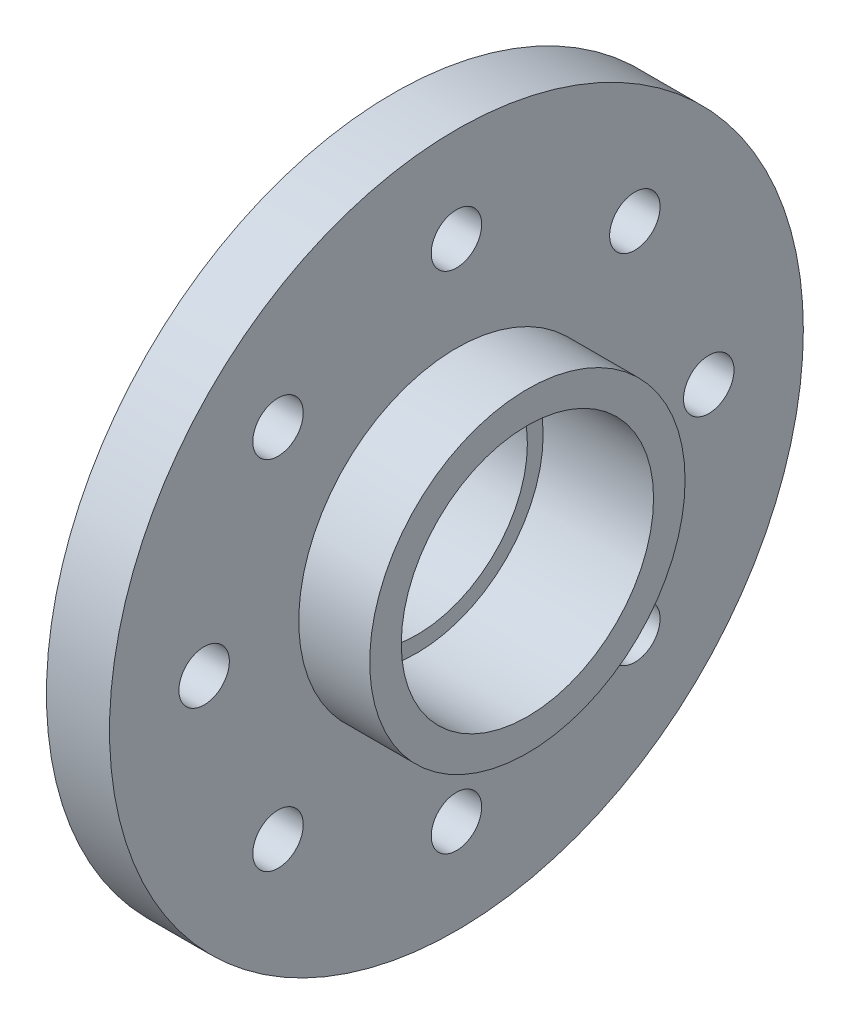
ISO-10303-21;
HEADER;
FILE_DESCRIPTION(('STEP AP214'),'2;1');
FILE_NAME('part.step','',(''),(''),'','','');
FILE_SCHEMA(('AUTOMOTIVE_DESIGN { 1 0 10303 214 1 1 1 1 }'));
ENDSEC;
DATA;
#1=APPLICATION_CONTEXT('core data for automotive mechanical design processes');
#2=APPLICATION_PROTOCOL_DEFINITION('international standard','automotive_design',2000,#1);
#3=PRODUCT_CONTEXT('',#1,'mechanical');
#4=PRODUCT('Part','Part','',(#3));
#5=PRODUCT_RELATED_PRODUCT_CATEGORY('part','',(#4));
#6=PRODUCT_DEFINITION_FORMATION('','',#4);
#7=PRODUCT_DEFINITION_CONTEXT('part definition',#1,'design');
#8=PRODUCT_DEFINITION('design','',#6,#7);
#9=PRODUCT_DEFINITION_SHAPE('','',#8);
#10=(LENGTH_UNIT() NAMED_UNIT(*) SI_UNIT(.MILLI.,.METRE.));
#11=(NAMED_UNIT(*) PLANE_ANGLE_UNIT() SI_UNIT($,.RADIAN.));
#12=(NAMED_UNIT(*) SI_UNIT($,.STERADIAN.) SOLID_ANGLE_UNIT());
#13=UNCERTAINTY_MEASURE_WITH_UNIT(LENGTH_MEASURE(1.E-05),#10,'distance_accuracy_value','');
#14=(GEOMETRIC_REPRESENTATION_CONTEXT(3) GLOBAL_UNCERTAINTY_ASSIGNED_CONTEXT((#13)) GLOBAL_UNIT_ASSIGNED_CONTEXT((#10,
#11,#12)) REPRESENTATION_CONTEXT('',''));
#15=CARTESIAN_POINT('',(0.,0.,0.));
#16=DIRECTION('',(0.,0.,1.));
#17=DIRECTION('',(1.,0.,0.));
#18=AXIS2_PLACEMENT_3D('',#15,#16,#17);
#19=CARTESIAN_POINT('',(3.25,0.,0.));
#20=DIRECTION('',(1.,0.,0.));
#21=DIRECTION('',(0.,0.,-1.));
#22=AXIS2_PLACEMENT_3D('',#19,#20,#21);
#23=PLANE('',#22);
#24=CARTESIAN_POINT('',(3.25,0.,-8.));
#25=DIRECTION('',(1.,0.,0.));
#26=DIRECTION('',(0.,0.,-1.));
#27=AXIS2_PLACEMENT_3D('',#24,#25,#26);
#28=CIRCLE('',#27,0.79999999999999);
#29=CARTESIAN_POINT('',(3.25,0.,-8.79999999999999));
#30=VERTEX_POINT('',#29);
#31=EDGE_CURVE('E125',#30,#30,#28,.T.);
#32=ORIENTED_EDGE('',*,*,#31,.F.);
#33=EDGE_LOOP('',(#32));
#34=FACE_BOUND('',#33,.T.);
#35=CARTESIAN_POINT('',(3.25,8.,0.));
#36=DIRECTION('',(1.,0.,0.));
#37=DIRECTION('',(0.,0.,-1.));
#38=AXIS2_PLACEMENT_3D('',#35,#36,#37);
#39=CIRCLE('',#38,0.79999999999999);
#40=CARTESIAN_POINT('',(3.25,8.,-0.79999999999999));
#41=VERTEX_POINT('',#40);
#42=EDGE_CURVE('E119',#41,#41,#39,.T.);
#43=ORIENTED_EDGE('',*,*,#42,.F.);
#44=EDGE_LOOP('',(#43));
#45=FACE_BOUND('',#44,.T.);
#46=CARTESIAN_POINT('',(3.25,5.65685424949245,5.65685424949231));
#47=DIRECTION('',(1.,0.,0.));
#48=DIRECTION('',(0.,0.,-1.));
#49=AXIS2_PLACEMENT_3D('',#46,#47,#48);
#50=CIRCLE('',#49,0.79999999999999);
#51=CARTESIAN_POINT('',(3.25,5.65685424949245,4.85685424949232));
#52=VERTEX_POINT('',#51);
#53=EDGE_CURVE('E113',#52,#52,#50,.T.);
#54=ORIENTED_EDGE('',*,*,#53,.F.);
#55=EDGE_LOOP('',(#54));
#56=FACE_BOUND('',#55,.T.);
#57=CARTESIAN_POINT('',(3.25,5.65685424949237,-5.65685424949239));
#58=DIRECTION('',(1.,0.,0.));
#59=DIRECTION('',(0.,0.,-1.));
#60=AXIS2_PLACEMENT_3D('',#57,#58,#59);
#61=CIRCLE('',#60,0.79999999999999);
#62=CARTESIAN_POINT('',(3.25,5.65685424949237,-6.45685424949238));
#63=VERTEX_POINT('',#62);
#64=EDGE_CURVE('E110',#63,#63,#61,.T.);
#65=ORIENTED_EDGE('',*,*,#64,.F.);
#66=EDGE_LOOP('',(#65));
#67=FACE_BOUND('',#66,.T.);
#68=CARTESIAN_POINT('',(3.25,-5.65685424949241,-5.65685424949235));
#69=DIRECTION('',(1.,0.,0.));
#70=DIRECTION('',(0.,0.,-1.));
#71=AXIS2_PLACEMENT_3D('',#68,#69,#70);
#72=CIRCLE('',#71,0.79999999999999);
#73=CARTESIAN_POINT('',(3.25,-5.65685424949241,-6.45685424949234));
#74=VERTEX_POINT('',#73);
#75=EDGE_CURVE('E104',#74,#74,#72,.T.);
#76=ORIENTED_EDGE('',*,*,#75,.F.);
#77=EDGE_LOOP('',(#76));
#78=FACE_BOUND('',#77,.T.);
#79=CARTESIAN_POINT('',(3.25,-8.,0.));
#80=DIRECTION('',(1.,0.,0.));
#81=DIRECTION('',(0.,0.,-1.));
#82=AXIS2_PLACEMENT_3D('',#79,#80,#81);
#83=CIRCLE('',#82,0.79999999999999);
#84=CARTESIAN_POINT('',(3.25,-8.,-0.799999999999934));
#85=VERTEX_POINT('',#84);
#86=EDGE_CURVE('E98',#85,#85,#83,.T.);
#87=ORIENTED_EDGE('',*,*,#86,.F.);
#88=EDGE_LOOP('',(#87));
#89=FACE_BOUND('',#88,.T.);
#90=CARTESIAN_POINT('',(3.25,-5.65685424949233,5.65685424949243));
#91=DIRECTION('',(1.,0.,0.));
#92=DIRECTION('',(0.,0.,-1.));
#93=AXIS2_PLACEMENT_3D('',#90,#91,#92);
#94=CIRCLE('',#93,0.79999999999999);
#95=CARTESIAN_POINT('',(3.25,-5.65685424949233,4.85685424949244));
#96=VERTEX_POINT('',#95);
#97=EDGE_CURVE('E92',#96,#96,#94,.T.);
#98=ORIENTED_EDGE('',*,*,#97,.F.);
#99=EDGE_LOOP('',(#98));
#100=FACE_BOUND('',#99,.T.);
#101=CARTESIAN_POINT('',(3.25,0.,8.));
#102=DIRECTION('',(1.,0.,0.));
#103=DIRECTION('',(0.,0.,-1.));
#104=AXIS2_PLACEMENT_3D('',#101,#102,#103);
#105=CIRCLE('',#104,0.79999999999999);
#106=CARTESIAN_POINT('',(3.25,0.,7.20000000000001));
#107=VERTEX_POINT('',#106);
#108=EDGE_CURVE('E86',#107,#107,#105,.T.);
#109=ORIENTED_EDGE('',*,*,#108,.F.);
#110=EDGE_LOOP('',(#109));
#111=FACE_BOUND('',#110,.T.);
#112=CARTESIAN_POINT('',(3.25,0.,0.));
#113=DIRECTION('',(1.,0.,0.));
#114=DIRECTION('',(0.,0.,-1.));
#115=AXIS2_PLACEMENT_3D('',#112,#113,#114);
#116=CIRCLE('',#115,11.);
#117=CARTESIAN_POINT('',(3.25,0.,-11.));
#118=VERTEX_POINT('',#117);
#119=EDGE_CURVE('E66',#118,#118,#116,.T.);
#120=ORIENTED_EDGE('',*,*,#119,.T.);
#121=EDGE_LOOP('',(#120));
#122=FACE_BOUND('',#121,.T.);
#123=CARTESIAN_POINT('',(3.25,0.,0.));
#124=DIRECTION('',(1.,0.,0.));
#125=DIRECTION('',(0.,0.,-1.));
#126=AXIS2_PLACEMENT_3D('',#123,#124,#125);
#127=CIRCLE('',#126,5.);
#128=CARTESIAN_POINT('',(3.25,0.,-5.));
#129=VERTEX_POINT('',#128);
#130=EDGE_CURVE('E75',#129,#129,#127,.T.);
#131=ORIENTED_EDGE('',*,*,#130,.F.);
#132=EDGE_LOOP('',(#131));
#133=FACE_BOUND('',#132,.T.);
#134=ADVANCED_FACE('F45',(#34,#45,#56,#67,#78,#89,#100,#111,#122,#133),#23,.T.);
#135=CARTESIAN_POINT('',(2.,0.,0.));
#136=DIRECTION('',(-1.,0.,0.));
#137=DIRECTION('',(0.,0.,1.));
#138=AXIS2_PLACEMENT_3D('',#135,#136,#137);
#139=CYLINDRICAL_SURFACE('',#138,5.);
#140=CARTESIAN_POINT('',(0.,0.,0.));
#141=DIRECTION('',(1.,0.,0.));
#142=DIRECTION('',(0.,0.,-1.));
#143=AXIS2_PLACEMENT_3D('',#140,#141,#142);
#144=CIRCLE('',#143,5.);
#145=CARTESIAN_POINT('',(0.,0.,-5.));
#146=VERTEX_POINT('',#145);
#147=EDGE_CURVE('E57',#146,#146,#144,.T.);
#148=ORIENTED_EDGE('',*,*,#147,.T.);
#149=EDGE_LOOP('',(#148));
#150=FACE_BOUND('',#149,.T.);
#151=CARTESIAN_POINT('',(1.25,0.,0.));
#152=DIRECTION('',(1.,0.,0.));
#153=DIRECTION('',(0.,0.,-1.));
#154=AXIS2_PLACEMENT_3D('',#151,#152,#153);
#155=CIRCLE('',#154,5.);
#156=CARTESIAN_POINT('',(1.25,0.,-5.));
#157=VERTEX_POINT('',#156);
#158=EDGE_CURVE('E10',#157,#157,#155,.T.);
#159=ORIENTED_EDGE('',*,*,#158,.F.);
#160=EDGE_LOOP('',(#159));
#161=FACE_BOUND('',#160,.T.);
#162=ADVANCED_FACE('F47',(#150,#161),#139,.T.);
#163=CARTESIAN_POINT('',(2.,0.,0.));
#164=DIRECTION('',(1.,0.,0.));
#165=DIRECTION('',(0.,0.,-1.));
#166=AXIS2_PLACEMENT_3D('',#163,#164,#165);
#167=PLANE('',#166);
#168=CARTESIAN_POINT('',(2.,0.,0.));
#169=DIRECTION('',(1.,0.,0.));
#170=DIRECTION('',(0.,0.,-1.));
#171=AXIS2_PLACEMENT_3D('',#168,#169,#170);
#172=CIRCLE('',#171,4.);
#173=CARTESIAN_POINT('',(2.,0.,-4.));
#174=VERTEX_POINT('',#173);
#175=EDGE_CURVE('E53',#174,#174,#172,.F.);
#176=ORIENTED_EDGE('',*,*,#175,.F.);
#177=EDGE_LOOP('',(#176));
#178=FACE_BOUND('',#177,.T.);
#179=CARTESIAN_POINT('',(2.,0.,0.));
#180=DIRECTION('',(1.,0.,0.));
#181=DIRECTION('',(0.,0.,-1.));
#182=AXIS2_PLACEMENT_3D('',#179,#180,#181);
#183=CIRCLE('',#182,3.5);
#184=CARTESIAN_POINT('',(2.,0.,-3.5));
#185=VERTEX_POINT('',#184);
#186=EDGE_CURVE('E62',#185,#185,#183,.T.);
#187=ORIENTED_EDGE('',*,*,#186,.F.);
#188=EDGE_LOOP('',(#187));
#189=FACE_BOUND('',#188,.T.);
#190=ADVANCED_FACE('F188',(#178,#189),#167,.T.);
#191=CARTESIAN_POINT('',(0.,0.,0.));
#192=DIRECTION('',(1.,0.,0.));
#193=DIRECTION('',(0.,0.,-1.));
#194=AXIS2_PLACEMENT_3D('',#191,#192,#193);
#195=PLANE('',#194);
#196=ORIENTED_EDGE('',*,*,#147,.F.);
#197=EDGE_LOOP('',(#196));
#198=FACE_BOUND('',#197,.T.);
#199=CARTESIAN_POINT('',(0.,0.,0.));
#200=DIRECTION('',(1.,0.,0.));
#201=DIRECTION('',(0.,0.,-1.));
#202=AXIS2_PLACEMENT_3D('',#199,#200,#201);
#203=CIRCLE('',#202,3.5);
#204=CARTESIAN_POINT('',(0.,0.,-3.5));
#205=VERTEX_POINT('',#204);
#206=EDGE_CURVE('E63',#205,#205,#203,.T.);
#207=ORIENTED_EDGE('',*,*,#206,.T.);
#208=EDGE_LOOP('',(#207));
#209=FACE_BOUND('',#208,.T.);
#210=ADVANCED_FACE('F186',(#198,#209),#195,.F.);
#211=CARTESIAN_POINT('',(2.,0.,0.));
#212=DIRECTION('',(-1.,0.,0.));
#213=DIRECTION('',(0.,0.,1.));
#214=AXIS2_PLACEMENT_3D('',#211,#212,#213);
#215=CYLINDRICAL_SURFACE('',#214,3.5);
#216=ORIENTED_EDGE('',*,*,#186,.T.);
#217=EDGE_LOOP('',(#216));
#218=FACE_BOUND('',#217,.T.);
#219=ORIENTED_EDGE('',*,*,#206,.F.);
#220=EDGE_LOOP('',(#219));
#221=FACE_BOUND('',#220,.T.);
#222=ADVANCED_FACE('F182',(#218,#221),#215,.F.);
#223=CARTESIAN_POINT('',(3.25,0.,0.));
#224=DIRECTION('',(-1.,0.,0.));
#225=DIRECTION('',(0.,0.,1.));
#226=AXIS2_PLACEMENT_3D('',#223,#224,#225);
#227=CYLINDRICAL_SURFACE('',#226,11.);
#228=ORIENTED_EDGE('',*,*,#119,.F.);
#229=EDGE_LOOP('',(#228));
#230=FACE_BOUND('',#229,.T.);
#231=CARTESIAN_POINT('',(1.25,0.,0.));
#232=DIRECTION('',(1.,0.,0.));
#233=DIRECTION('',(0.,0.,-1.));
#234=AXIS2_PLACEMENT_3D('',#231,#232,#233);
#235=CIRCLE('',#234,11.);
#236=CARTESIAN_POINT('',(1.25,0.,-11.));
#237=VERTEX_POINT('',#236);
#238=EDGE_CURVE('E71',#237,#237,#235,.T.);
#239=ORIENTED_EDGE('',*,*,#238,.T.);
#240=EDGE_LOOP('',(#239));
#241=FACE_BOUND('',#240,.T.);
#242=ADVANCED_FACE('F177',(#230,#241),#227,.T.);
#243=CARTESIAN_POINT('',(3.25,0.,0.));
#244=DIRECTION('',(-1.,0.,0.));
#245=DIRECTION('',(0.,0.,1.));
#246=AXIS2_PLACEMENT_3D('',#243,#244,#245);
#247=CYLINDRICAL_SURFACE('',#246,4.);
#248=ORIENTED_EDGE('',*,*,#175,.T.);
#249=EDGE_LOOP('',(#248));
#250=FACE_BOUND('',#249,.T.);
#251=CARTESIAN_POINT('',(5.5,0.,0.));
#252=DIRECTION('',(1.,0.,0.));
#253=DIRECTION('',(0.,0.,-1.));
#254=AXIS2_PLACEMENT_3D('',#251,#252,#253);
#255=CIRCLE('',#254,4.);
#256=CARTESIAN_POINT('',(5.5,0.,-4.));
#257=VERTEX_POINT('',#256);
#258=EDGE_CURVE('E78',#257,#257,#255,.T.);
#259=ORIENTED_EDGE('',*,*,#258,.T.);
#260=EDGE_LOOP('',(#259));
#261=FACE_BOUND('',#260,.T.);
#262=ADVANCED_FACE('F174',(#250,#261),#247,.F.);
#263=CARTESIAN_POINT('',(1.25,0.,0.));
#264=DIRECTION('',(1.,0.,0.));
#265=DIRECTION('',(0.,0.,-1.));
#266=AXIS2_PLACEMENT_3D('',#263,#264,#265);
#267=PLANE('',#266);
#268=CARTESIAN_POINT('',(1.25,0.,-8.));
#269=DIRECTION('',(1.,0.,0.));
#270=DIRECTION('',(0.,0.,-1.));
#271=AXIS2_PLACEMENT_3D('',#268,#269,#270);
#272=CIRCLE('',#271,0.799999999999989);
#273=CARTESIAN_POINT('',(1.25,0.,-8.79999999999999));
#274=VERTEX_POINT('',#273);
#275=EDGE_CURVE('E122',#274,#274,#272,.T.);
#276=ORIENTED_EDGE('',*,*,#275,.T.);
#277=EDGE_LOOP('',(#276));
#278=FACE_BOUND('',#277,.T.);
#279=CARTESIAN_POINT('',(1.25,8.,0.));
#280=DIRECTION('',(1.,0.,0.));
#281=DIRECTION('',(0.,0.,-1.));
#282=AXIS2_PLACEMENT_3D('',#279,#280,#281);
#283=CIRCLE('',#282,0.799999999999989);
#284=CARTESIAN_POINT('',(1.25,8.,-0.799999999999989));
#285=VERTEX_POINT('',#284);
#286=EDGE_CURVE('E116',#285,#285,#283,.T.);
#287=ORIENTED_EDGE('',*,*,#286,.T.);
#288=EDGE_LOOP('',(#287));
#289=FACE_BOUND('',#288,.T.);
#290=CARTESIAN_POINT('',(1.25,5.65685424949245,5.65685424949231));
#291=DIRECTION('',(1.,0.,0.));
#292=DIRECTION('',(0.,0.,-1.));
#293=AXIS2_PLACEMENT_3D('',#290,#291,#292);
#294=CIRCLE('',#293,0.799999999999989);
#295=CARTESIAN_POINT('',(1.25,5.65685424949245,4.85685424949232));
#296=VERTEX_POINT('',#295);
#297=EDGE_CURVE('E49',#296,#296,#294,.T.);
#298=ORIENTED_EDGE('',*,*,#297,.T.);
#299=EDGE_LOOP('',(#298));
#300=FACE_BOUND('',#299,.T.);
#301=CARTESIAN_POINT('',(1.25,5.65685424949237,-5.65685424949239));
#302=DIRECTION('',(1.,0.,0.));
#303=DIRECTION('',(0.,0.,-1.));
#304=AXIS2_PLACEMENT_3D('',#301,#302,#303);
#305=CIRCLE('',#304,0.799999999999989);
#306=CARTESIAN_POINT('',(1.25,5.65685424949237,-6.45685424949238));
#307=VERTEX_POINT('',#306);
#308=EDGE_CURVE('E107',#307,#307,#305,.T.);
#309=ORIENTED_EDGE('',*,*,#308,.T.);
#310=EDGE_LOOP('',(#309));
#311=FACE_BOUND('',#310,.T.);
#312=CARTESIAN_POINT('',(1.25,-5.65685424949241,-5.65685424949235));
#313=DIRECTION('',(1.,0.,0.));
#314=DIRECTION('',(0.,0.,-1.));
#315=AXIS2_PLACEMENT_3D('',#312,#313,#314);
#316=CIRCLE('',#315,0.799999999999989);
#317=CARTESIAN_POINT('',(1.25,-5.65685424949241,-6.45685424949234));
#318=VERTEX_POINT('',#317);
#319=EDGE_CURVE('E101',#318,#318,#316,.T.);
#320=ORIENTED_EDGE('',*,*,#319,.T.);
#321=EDGE_LOOP('',(#320));
#322=FACE_BOUND('',#321,.T.);
#323=CARTESIAN_POINT('',(1.25,-8.,0.));
#324=DIRECTION('',(1.,0.,0.));
#325=DIRECTION('',(0.,0.,-1.));
#326=AXIS2_PLACEMENT_3D('',#323,#324,#325);
#327=CIRCLE('',#326,0.799999999999989);
#328=CARTESIAN_POINT('',(1.25,-8.,-0.799999999999933));
#329=VERTEX_POINT('',#328);
#330=EDGE_CURVE('E95',#329,#329,#327,.T.);
#331=ORIENTED_EDGE('',*,*,#330,.T.);
#332=EDGE_LOOP('',(#331));
#333=FACE_BOUND('',#332,.T.);
#334=CARTESIAN_POINT('',(1.25,-5.65685424949233,5.65685424949243));
#335=DIRECTION('',(1.,0.,0.));
#336=DIRECTION('',(0.,0.,-1.));
#337=AXIS2_PLACEMENT_3D('',#334,#335,#336);
#338=CIRCLE('',#337,0.799999999999989);
#339=CARTESIAN_POINT('',(1.25,-5.65685424949233,4.85685424949244));
#340=VERTEX_POINT('',#339);
#341=EDGE_CURVE('E89',#340,#340,#338,.T.);
#342=ORIENTED_EDGE('',*,*,#341,.T.);
#343=EDGE_LOOP('',(#342));
#344=FACE_BOUND('',#343,.T.);
#345=CARTESIAN_POINT('',(1.25,0.,8.));
#346=DIRECTION('',(1.,0.,0.));
#347=DIRECTION('',(0.,0.,-1.));
#348=AXIS2_PLACEMENT_3D('',#345,#346,#347);
#349=CIRCLE('',#348,0.799999999999989);
#350=CARTESIAN_POINT('',(1.25,0.,7.20000000000001));
#351=VERTEX_POINT('',#350);
#352=EDGE_CURVE('E83',#351,#351,#349,.T.);
#353=ORIENTED_EDGE('',*,*,#352,.T.);
#354=EDGE_LOOP('',(#353));
#355=FACE_BOUND('',#354,.T.);
#356=ORIENTED_EDGE('',*,*,#238,.F.);
#357=EDGE_LOOP('',(#356));
#358=FACE_BOUND('',#357,.T.);
#359=ORIENTED_EDGE('',*,*,#158,.T.);
#360=EDGE_LOOP('',(#359));
#361=FACE_BOUND('',#360,.T.);
#362=ADVANCED_FACE('F167',(#278,#289,#300,#311,#322,#333,#344,#355,#358,#361),#267,.F.);
#363=CARTESIAN_POINT('',(5.5,0.,0.));
#364=DIRECTION('',(1.,0.,0.));
#365=DIRECTION('',(0.,0.,-1.));
#366=AXIS2_PLACEMENT_3D('',#363,#364,#365);
#367=PLANE('',#366);
#368=CARTESIAN_POINT('',(5.5,0.,0.));
#369=DIRECTION('',(1.,0.,0.));
#370=DIRECTION('',(0.,0.,-1.));
#371=AXIS2_PLACEMENT_3D('',#368,#369,#370);
#372=CIRCLE('',#371,5.);
#373=CARTESIAN_POINT('',(5.5,0.,-5.));
#374=VERTEX_POINT('',#373);
#375=EDGE_CURVE('E74',#374,#374,#372,.T.);
#376=ORIENTED_EDGE('',*,*,#375,.T.);
#377=EDGE_LOOP('',(#376));
#378=FACE_BOUND('',#377,.T.);
#379=ORIENTED_EDGE('',*,*,#258,.F.);
#380=EDGE_LOOP('',(#379));
#381=FACE_BOUND('',#380,.T.);
#382=ADVANCED_FACE('F156',(#378,#381),#367,.T.);
#383=CARTESIAN_POINT('',(5.5,0.,0.));
#384=DIRECTION('',(-1.,0.,0.));
#385=DIRECTION('',(0.,0.,1.));
#386=AXIS2_PLACEMENT_3D('',#383,#384,#385);
#387=CYLINDRICAL_SURFACE('',#386,5.);
#388=ORIENTED_EDGE('',*,*,#375,.F.);
#389=EDGE_LOOP('',(#388));
#390=FACE_BOUND('',#389,.T.);
#391=ORIENTED_EDGE('',*,*,#130,.T.);
#392=EDGE_LOOP('',(#391));
#393=FACE_BOUND('',#392,.T.);
#394=ADVANCED_FACE('F153',(#390,#393),#387,.T.);
#395=CARTESIAN_POINT('',(3.25,0.,8.));
#396=DIRECTION('',(1.,0.,0.));
#397=DIRECTION('',(0.,0.,-1.));
#398=AXIS2_PLACEMENT_3D('',#395,#396,#397);
#399=CYLINDRICAL_SURFACE('',#398,0.799999999999989);
#400=ORIENTED_EDGE('',*,*,#108,.T.);
#401=EDGE_LOOP('',(#400));
#402=FACE_BOUND('',#401,.T.);
#403=ORIENTED_EDGE('',*,*,#352,.F.);
#404=EDGE_LOOP('',(#403));
#405=FACE_BOUND('',#404,.T.);
#406=ADVANCED_FACE('F155',(#402,#405),#399,.F.);
#407=CARTESIAN_POINT('',(3.25,-5.65685424949233,5.65685424949243));
#408=DIRECTION('',(1.,0.,0.));
#409=DIRECTION('',(0.,0.,-1.));
#410=AXIS2_PLACEMENT_3D('',#407,#408,#409);
#411=CYLINDRICAL_SURFACE('',#410,0.799999999999989);
#412=ORIENTED_EDGE('',*,*,#97,.T.);
#413=EDGE_LOOP('',(#412));
#414=FACE_BOUND('',#413,.T.);
#415=ORIENTED_EDGE('',*,*,#341,.F.);
#416=EDGE_LOOP('',(#415));
#417=FACE_BOUND('',#416,.T.);
#418=ADVANCED_FACE('F164',(#414,#417),#411,.F.);
#419=CARTESIAN_POINT('',(3.25,-8.,0.));
#420=DIRECTION('',(1.,0.,0.));
#421=DIRECTION('',(0.,0.,-1.));
#422=AXIS2_PLACEMENT_3D('',#419,#420,#421);
#423=CYLINDRICAL_SURFACE('',#422,0.799999999999989);
#424=ORIENTED_EDGE('',*,*,#86,.T.);
#425=EDGE_LOOP('',(#424));
#426=FACE_BOUND('',#425,.T.);
#427=ORIENTED_EDGE('',*,*,#330,.F.);
#428=EDGE_LOOP('',(#427));
#429=FACE_BOUND('',#428,.T.);
#430=ADVANCED_FACE('F238',(#426,#429),#423,.F.);
#431=CARTESIAN_POINT('',(3.25,-5.65685424949241,-5.65685424949235));
#432=DIRECTION('',(1.,0.,0.));
#433=DIRECTION('',(0.,0.,-1.));
#434=AXIS2_PLACEMENT_3D('',#431,#432,#433);
#435=CYLINDRICAL_SURFACE('',#434,0.799999999999989);
#436=ORIENTED_EDGE('',*,*,#75,.T.);
#437=EDGE_LOOP('',(#436));
#438=FACE_BOUND('',#437,.T.);
#439=ORIENTED_EDGE('',*,*,#319,.F.);
#440=EDGE_LOOP('',(#439));
#441=FACE_BOUND('',#440,.T.);
#442=ADVANCED_FACE('F248',(#438,#441),#435,.F.);
#443=CARTESIAN_POINT('',(3.25,5.65685424949237,-5.65685424949239));
#444=DIRECTION('',(1.,0.,0.));
#445=DIRECTION('',(0.,0.,-1.));
#446=AXIS2_PLACEMENT_3D('',#443,#444,#445);
#447=CYLINDRICAL_SURFACE('',#446,0.799999999999989);
#448=ORIENTED_EDGE('',*,*,#64,.T.);
#449=EDGE_LOOP('',(#448));
#450=FACE_BOUND('',#449,.T.);
#451=ORIENTED_EDGE('',*,*,#308,.F.);
#452=EDGE_LOOP('',(#451));
#453=FACE_BOUND('',#452,.T.);
#454=ADVANCED_FACE('F258',(#450,#453),#447,.F.);
#455=CARTESIAN_POINT('',(3.25,5.65685424949245,5.65685424949231));
#456=DIRECTION('',(1.,0.,0.));
#457=DIRECTION('',(0.,0.,-1.));
#458=AXIS2_PLACEMENT_3D('',#455,#456,#457);
#459=CYLINDRICAL_SURFACE('',#458,0.799999999999989);
#460=ORIENTED_EDGE('',*,*,#53,.T.);
#461=EDGE_LOOP('',(#460));
#462=FACE_BOUND('',#461,.T.);
#463=ORIENTED_EDGE('',*,*,#297,.F.);
#464=EDGE_LOOP('',(#463));
#465=FACE_BOUND('',#464,.T.);
#466=ADVANCED_FACE('F268',(#462,#465),#459,.F.);
#467=CARTESIAN_POINT('',(3.25,8.,0.));
#468=DIRECTION('',(1.,0.,0.));
#469=DIRECTION('',(0.,0.,-1.));
#470=AXIS2_PLACEMENT_3D('',#467,#468,#469);
#471=CYLINDRICAL_SURFACE('',#470,0.799999999999989);
#472=ORIENTED_EDGE('',*,*,#42,.T.);
#473=EDGE_LOOP('',(#472));
#474=FACE_BOUND('',#473,.T.);
#475=ORIENTED_EDGE('',*,*,#286,.F.);
#476=EDGE_LOOP('',(#475));
#477=FACE_BOUND('',#476,.T.);
#478=ADVANCED_FACE('F278',(#474,#477),#471,.F.);
#479=CARTESIAN_POINT('',(3.25,0.,-8.));
#480=DIRECTION('',(1.,0.,0.));
#481=DIRECTION('',(0.,0.,-1.));
#482=AXIS2_PLACEMENT_3D('',#479,#480,#481);
#483=CYLINDRICAL_SURFACE('',#482,0.799999999999989);
#484=ORIENTED_EDGE('',*,*,#31,.T.);
#485=EDGE_LOOP('',(#484));
#486=FACE_BOUND('',#485,.T.);
#487=ORIENTED_EDGE('',*,*,#275,.F.);
#488=EDGE_LOOP('',(#487));
#489=FACE_BOUND('',#488,.T.);
#490=ADVANCED_FACE('F129',(#486,#489),#483,.F.);
#491=CLOSED_SHELL('',(#134,#162,#190,#210,#222,#242,#262,#362,#382,#394,#406,#418,#430,#442,
#454,#466,#478,#490));
#492=MANIFOLD_SOLID_BREP('B2',#491);
#493=ADVANCED_BREP_SHAPE_REPRESENTATION('',(#18,#492),#14);
#494=SHAPE_DEFINITION_REPRESENTATION(#9,#493);
ENDSEC;
END-ISO-10303-21;
